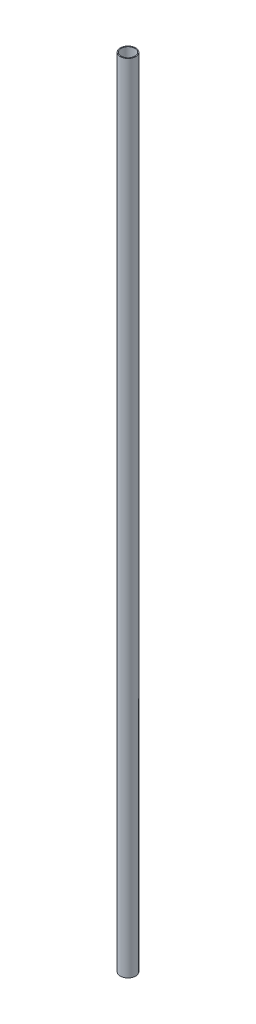
ISO-10303-21;
HEADER;
FILE_DESCRIPTION(('STEP AP214'),'2;1');
FILE_NAME('part.step','',(''),(''),'','','');
FILE_SCHEMA(('AUTOMOTIVE_DESIGN { 1 0 10303 214 1 1 1 1 }'));
ENDSEC;
DATA;
#1=APPLICATION_CONTEXT('core data for automotive mechanical design processes');
#2=APPLICATION_PROTOCOL_DEFINITION('international standard','automotive_design',2000,#1);
#3=PRODUCT_CONTEXT('',#1,'mechanical');
#4=PRODUCT('Part','Part','',(#3));
#5=PRODUCT_RELATED_PRODUCT_CATEGORY('part','',(#4));
#6=PRODUCT_DEFINITION_FORMATION('','',#4);
#7=PRODUCT_DEFINITION_CONTEXT('part definition',#1,'design');
#8=PRODUCT_DEFINITION('design','',#6,#7);
#9=PRODUCT_DEFINITION_SHAPE('','',#8);
#10=(LENGTH_UNIT() NAMED_UNIT(*) SI_UNIT(.MILLI.,.METRE.));
#11=(NAMED_UNIT(*) PLANE_ANGLE_UNIT() SI_UNIT($,.RADIAN.));
#12=(NAMED_UNIT(*) SI_UNIT($,.STERADIAN.) SOLID_ANGLE_UNIT());
#13=UNCERTAINTY_MEASURE_WITH_UNIT(LENGTH_MEASURE(1.E-05),#10,'distance_accuracy_value','');
#14=(GEOMETRIC_REPRESENTATION_CONTEXT(3) GLOBAL_UNCERTAINTY_ASSIGNED_CONTEXT((#13)) GLOBAL_UNIT_ASSIGNED_CONTEXT((#10,
#11,#12)) REPRESENTATION_CONTEXT('',''));
#15=CARTESIAN_POINT('',(0.,0.,0.));
#16=DIRECTION('',(0.,0.,1.));
#17=DIRECTION('',(1.,0.,0.));
#18=AXIS2_PLACEMENT_3D('',#15,#16,#17);
#19=CARTESIAN_POINT('',(0.,0.,0.));
#20=DIRECTION('',(0.,1.,0.));
#21=DIRECTION('',(0.,0.,1.));
#22=AXIS2_PLACEMENT_3D('',#19,#20,#21);
#23=CYLINDRICAL_SURFACE('',#22,16.9418);
#24=CARTESIAN_POINT('',(0.,1981.2,0.));
#25=DIRECTION('',(0.,1.,0.));
#26=DIRECTION('',(0.,0.,1.));
#27=AXIS2_PLACEMENT_3D('',#24,#25,#26);
#28=CIRCLE('',#27,16.9418);
#29=CARTESIAN_POINT('',(0.,1981.2,16.9418));
#30=VERTEX_POINT('',#29);
#31=EDGE_CURVE('E18',#30,#30,#28,.F.);
#32=ORIENTED_EDGE('',*,*,#31,.F.);
#33=EDGE_LOOP('',(#32));
#34=FACE_BOUND('',#33,.T.);
#35=CARTESIAN_POINT('',(0.,0.,0.));
#36=DIRECTION('',(0.,1.,0.));
#37=DIRECTION('',(0.,0.,1.));
#38=AXIS2_PLACEMENT_3D('',#35,#36,#37);
#39=CIRCLE('',#38,16.9418);
#40=CARTESIAN_POINT('',(0.,0.,16.9418));
#41=VERTEX_POINT('',#40);
#42=EDGE_CURVE('E27',#41,#41,#39,.F.);
#43=ORIENTED_EDGE('',*,*,#42,.T.);
#44=EDGE_LOOP('',(#43));
#45=FACE_BOUND('',#44,.T.);
#46=ADVANCED_FACE('F15',(#34,#45),#23,.F.);
#47=CARTESIAN_POINT('',(0.,1981.2,0.));
#48=DIRECTION('',(0.,1.,0.));
#49=DIRECTION('',(0.,0.,1.));
#50=AXIS2_PLACEMENT_3D('',#47,#48,#49);
#51=PLANE('',#50);
#52=ORIENTED_EDGE('',*,*,#31,.T.);
#53=EDGE_LOOP('',(#52));
#54=FACE_BOUND('',#53,.T.);
#55=CARTESIAN_POINT('',(0.,1981.2,0.));
#56=DIRECTION('',(0.,1.,0.));
#57=DIRECTION('',(0.,0.,1.));
#58=AXIS2_PLACEMENT_3D('',#55,#56,#57);
#59=CIRCLE('',#58,19.05);
#60=CARTESIAN_POINT('',(0.,1981.2,19.05));
#61=VERTEX_POINT('',#60);
#62=EDGE_CURVE('E22',#61,#61,#59,.F.);
#63=ORIENTED_EDGE('',*,*,#62,.F.);
#64=EDGE_LOOP('',(#63));
#65=FACE_BOUND('',#64,.T.);
#66=ADVANCED_FACE('F35',(#54,#65),#51,.T.);
#67=CARTESIAN_POINT('',(0.,0.,0.));
#68=DIRECTION('',(0.,1.,0.));
#69=DIRECTION('',(0.,0.,1.));
#70=AXIS2_PLACEMENT_3D('',#67,#68,#69);
#71=PLANE('',#70);
#72=ORIENTED_EDGE('',*,*,#42,.F.);
#73=EDGE_LOOP('',(#72));
#74=FACE_BOUND('',#73,.T.);
#75=CARTESIAN_POINT('',(0.,0.,0.));
#76=DIRECTION('',(0.,1.,0.));
#77=DIRECTION('',(0.,0.,1.));
#78=AXIS2_PLACEMENT_3D('',#75,#76,#77);
#79=CIRCLE('',#78,19.05);
#80=CARTESIAN_POINT('',(0.,0.,19.05));
#81=VERTEX_POINT('',#80);
#82=EDGE_CURVE('E10',#81,#81,#79,.T.);
#83=ORIENTED_EDGE('',*,*,#82,.F.);
#84=EDGE_LOOP('',(#83));
#85=FACE_BOUND('',#84,.T.);
#86=ADVANCED_FACE('F43',(#74,#85),#71,.F.);
#87=CARTESIAN_POINT('',(0.,0.,0.));
#88=DIRECTION('',(0.,1.,0.));
#89=DIRECTION('',(0.,0.,1.));
#90=AXIS2_PLACEMENT_3D('',#87,#88,#89);
#91=CYLINDRICAL_SURFACE('',#90,19.05);
#92=ORIENTED_EDGE('',*,*,#62,.T.);
#93=EDGE_LOOP('',(#92));
#94=FACE_BOUND('',#93,.T.);
#95=ORIENTED_EDGE('',*,*,#82,.T.);
#96=EDGE_LOOP('',(#95));
#97=FACE_BOUND('',#96,.T.);
#98=ADVANCED_FACE('F44',(#94,#97),#91,.T.);
#99=CLOSED_SHELL('',(#46,#66,#86,#98));
#100=MANIFOLD_SOLID_BREP('B1',#99);
#101=ADVANCED_BREP_SHAPE_REPRESENTATION('',(#18,#100),#14);
#102=SHAPE_DEFINITION_REPRESENTATION(#9,#101);
ENDSEC;
END-ISO-10303-21;
